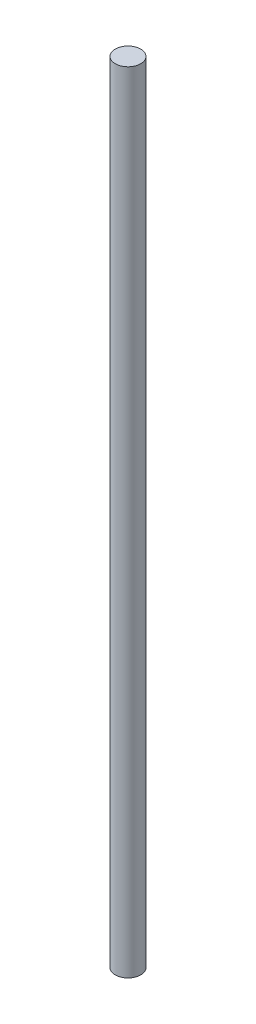
ISO-10303-21;
HEADER;
FILE_DESCRIPTION(('STEP AP214'),'2;1');
FILE_NAME('part.step','',(''),(''),'','','');
FILE_SCHEMA(('AUTOMOTIVE_DESIGN { 1 0 10303 214 1 1 1 1 }'));
ENDSEC;
DATA;
#1=APPLICATION_CONTEXT('core data for automotive mechanical design processes');
#2=APPLICATION_PROTOCOL_DEFINITION('international standard','automotive_design',2000,#1);
#3=PRODUCT_CONTEXT('',#1,'mechanical');
#4=PRODUCT('Part','Part','',(#3));
#5=PRODUCT_RELATED_PRODUCT_CATEGORY('part','',(#4));
#6=PRODUCT_DEFINITION_FORMATION('','',#4);
#7=PRODUCT_DEFINITION_CONTEXT('part definition',#1,'design');
#8=PRODUCT_DEFINITION('design','',#6,#7);
#9=PRODUCT_DEFINITION_SHAPE('','',#8);
#10=(LENGTH_UNIT() NAMED_UNIT(*) SI_UNIT(.MILLI.,.METRE.));
#11=(NAMED_UNIT(*) PLANE_ANGLE_UNIT() SI_UNIT($,.RADIAN.));
#12=(NAMED_UNIT(*) SI_UNIT($,.STERADIAN.) SOLID_ANGLE_UNIT());
#13=UNCERTAINTY_MEASURE_WITH_UNIT(LENGTH_MEASURE(1.E-05),#10,'distance_accuracy_value','');
#14=(GEOMETRIC_REPRESENTATION_CONTEXT(3) GLOBAL_UNCERTAINTY_ASSIGNED_CONTEXT((#13)) GLOBAL_UNIT_ASSIGNED_CONTEXT((#10,
#11,#12)) REPRESENTATION_CONTEXT('',''));
#15=CARTESIAN_POINT('',(0.,0.,0.));
#16=DIRECTION('',(0.,0.,1.));
#17=DIRECTION('',(1.,0.,0.));
#18=AXIS2_PLACEMENT_3D('',#15,#16,#17);
#19=CARTESIAN_POINT('',(0.,155.,0.));
#20=DIRECTION('',(0.,-1.,0.));
#21=DIRECTION('',(0.,0.,-1.));
#22=AXIS2_PLACEMENT_3D('',#19,#20,#21);
#23=CYLINDRICAL_SURFACE('',#22,2.5);
#24=CARTESIAN_POINT('',(0.,155.,0.));
#25=DIRECTION('',(0.,1.,0.));
#26=DIRECTION('',(0.,0.,1.));
#27=AXIS2_PLACEMENT_3D('',#24,#25,#26);
#28=CIRCLE('',#27,2.5);
#29=CARTESIAN_POINT('',(0.,155.,2.5));
#30=VERTEX_POINT('',#29);
#31=EDGE_CURVE('E10',#30,#30,#28,.T.);
#32=ORIENTED_EDGE('',*,*,#31,.F.);
#33=EDGE_LOOP('',(#32));
#34=FACE_BOUND('',#33,.T.);
#35=CARTESIAN_POINT('',(0.,0.,0.));
#36=DIRECTION('',(0.,1.,0.));
#37=DIRECTION('',(0.,0.,1.));
#38=AXIS2_PLACEMENT_3D('',#35,#36,#37);
#39=CIRCLE('',#38,2.5);
#40=CARTESIAN_POINT('',(0.,0.,2.5));
#41=VERTEX_POINT('',#40);
#42=EDGE_CURVE('E36',#41,#41,#39,.T.);
#43=ORIENTED_EDGE('',*,*,#42,.T.);
#44=EDGE_LOOP('',(#43));
#45=FACE_BOUND('',#44,.T.);
#46=ADVANCED_FACE('F33',(#34,#45),#23,.T.);
#47=CARTESIAN_POINT('',(0.,155.,0.));
#48=DIRECTION('',(0.,1.,0.));
#49=DIRECTION('',(0.,0.,1.));
#50=AXIS2_PLACEMENT_3D('',#47,#48,#49);
#51=PLANE('',#50);
#52=ORIENTED_EDGE('',*,*,#31,.T.);
#53=EDGE_LOOP('',(#52));
#54=FACE_BOUND('',#53,.T.);
#55=ADVANCED_FACE('F48',(#54),#51,.T.);
#56=CARTESIAN_POINT('',(0.,0.,0.));
#57=DIRECTION('',(0.,1.,0.));
#58=DIRECTION('',(0.,0.,1.));
#59=AXIS2_PLACEMENT_3D('',#56,#57,#58);
#60=PLANE('',#59);
#61=ORIENTED_EDGE('',*,*,#42,.F.);
#62=EDGE_LOOP('',(#61));
#63=FACE_BOUND('',#62,.T.);
#64=ADVANCED_FACE('F46',(#63),#60,.F.);
#65=CLOSED_SHELL('',(#46,#55,#64));
#66=MANIFOLD_SOLID_BREP('B2',#65);
#67=ADVANCED_BREP_SHAPE_REPRESENTATION('',(#18,#66),#14);
#68=SHAPE_DEFINITION_REPRESENTATION(#9,#67);
ENDSEC;
END-ISO-10303-21;
